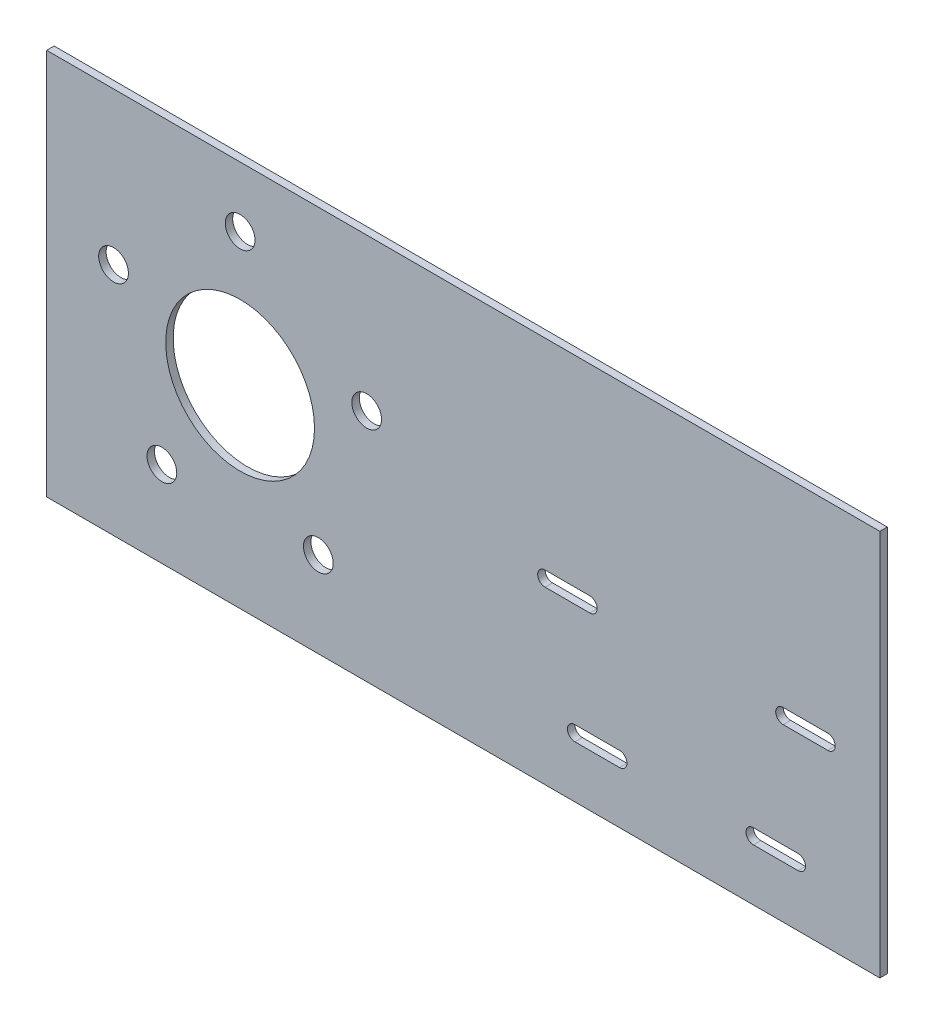
ISO-10303-21;
HEADER;
FILE_DESCRIPTION(('STEP AP214'),'2;1');
FILE_NAME('part.step','',(''),(''),'','','');
FILE_SCHEMA(('AUTOMOTIVE_DESIGN { 1 0 10303 214 1 1 1 1 }'));
ENDSEC;
DATA;
#1=APPLICATION_CONTEXT('core data for automotive mechanical design processes');
#2=APPLICATION_PROTOCOL_DEFINITION('international standard','automotive_design',2000,#1);
#3=PRODUCT_CONTEXT('',#1,'mechanical');
#4=PRODUCT('Part','Part','',(#3));
#5=PRODUCT_RELATED_PRODUCT_CATEGORY('part','',(#4));
#6=PRODUCT_DEFINITION_FORMATION('','',#4);
#7=PRODUCT_DEFINITION_CONTEXT('part definition',#1,'design');
#8=PRODUCT_DEFINITION('design','',#6,#7);
#9=PRODUCT_DEFINITION_SHAPE('','',#8);
#10=(LENGTH_UNIT() NAMED_UNIT(*) SI_UNIT(.MILLI.,.METRE.));
#11=(NAMED_UNIT(*) PLANE_ANGLE_UNIT() SI_UNIT($,.RADIAN.));
#12=(NAMED_UNIT(*) SI_UNIT($,.STERADIAN.) SOLID_ANGLE_UNIT());
#13=UNCERTAINTY_MEASURE_WITH_UNIT(LENGTH_MEASURE(1.E-05),#10,'distance_accuracy_value','');
#14=(GEOMETRIC_REPRESENTATION_CONTEXT(3) GLOBAL_UNCERTAINTY_ASSIGNED_CONTEXT((#13)) GLOBAL_UNIT_ASSIGNED_CONTEXT((#10,
#11,#12)) REPRESENTATION_CONTEXT('',''));
#15=CARTESIAN_POINT('',(0.,0.,0.));
#16=DIRECTION('',(0.,0.,1.));
#17=DIRECTION('',(1.,0.,0.));
#18=AXIS2_PLACEMENT_3D('',#15,#16,#17);
#19=CARTESIAN_POINT('',(-82.55,82.5499999999999,3.175));
#20=DIRECTION('',(0.,0.,1.));
#21=DIRECTION('',(1.,0.,0.));
#22=AXIS2_PLACEMENT_3D('',#19,#20,#21);
#23=PLANE('',#22);
#24=CARTESIAN_POINT('',(142.875,-57.15,3.175));
#25=DIRECTION('',(0.,0.,1.));
#26=DIRECTION('',(1.,0.,0.));
#27=AXIS2_PLACEMENT_3D('',#24,#25,#26);
#28=CIRCLE('',#27,3.17500000000001);
#29=CARTESIAN_POINT('',(142.875,-53.975,3.175));
#30=VERTEX_POINT('',#29);
#31=CARTESIAN_POINT('',(142.875,-60.325,3.175));
#32=VERTEX_POINT('',#31);
#33=EDGE_CURVE('E49',#30,#32,#28,.T.);
#34=ORIENTED_EDGE('',*,*,#33,.F.);
#35=DIRECTION('',(-1.,0.,0.));
#36=VECTOR('',#35,1.);
#37=CARTESIAN_POINT('',(142.875,-53.975,3.175));
#38=LINE('',#37,#36);
#39=CARTESIAN_POINT('',(161.925,-53.9749999999999,3.175));
#40=VERTEX_POINT('',#39);
#41=EDGE_CURVE('E189',#40,#30,#38,.T.);
#42=ORIENTED_EDGE('',*,*,#41,.F.);
#43=CARTESIAN_POINT('',(161.925,-57.15,3.175));
#44=DIRECTION('',(0.,0.,1.));
#45=DIRECTION('',(1.,0.,0.));
#46=AXIS2_PLACEMENT_3D('',#43,#44,#45);
#47=CIRCLE('',#46,3.17500000000001);
#48=CARTESIAN_POINT('',(161.925,-60.325,3.175));
#49=VERTEX_POINT('',#48);
#50=EDGE_CURVE('E192',#49,#40,#47,.T.);
#51=ORIENTED_EDGE('',*,*,#50,.F.);
#52=DIRECTION('',(1.,0.,0.));
#53=VECTOR('',#52,1.);
#54=CARTESIAN_POINT('',(142.875,-60.325,3.175));
#55=LINE('',#54,#53);
#56=EDGE_CURVE('E198',#32,#49,#55,.T.);
#57=ORIENTED_EDGE('',*,*,#56,.F.);
#58=EDGE_LOOP('',(#34,#42,#51,#57));
#59=FACE_BOUND('',#58,.T.);
#60=CARTESIAN_POINT('',(238.125,-57.15,3.175));
#61=DIRECTION('',(0.,0.,1.));
#62=DIRECTION('',(1.,0.,0.));
#63=AXIS2_PLACEMENT_3D('',#60,#61,#62);
#64=CIRCLE('',#63,3.17499999999999);
#65=CARTESIAN_POINT('',(238.125,-60.3249999999999,3.175));
#66=VERTEX_POINT('',#65);
#67=CARTESIAN_POINT('',(238.125,-53.975,3.175));
#68=VERTEX_POINT('',#67);
#69=EDGE_CURVE('E204',#66,#68,#64,.T.);
#70=ORIENTED_EDGE('',*,*,#69,.F.);
#71=DIRECTION('',(1.,0.,0.));
#72=VECTOR('',#71,1.);
#73=CARTESIAN_POINT('',(238.125,-60.3249999999999,3.175));
#74=LINE('',#73,#72);
#75=CARTESIAN_POINT('',(219.075,-60.325,3.175));
#76=VERTEX_POINT('',#75);
#77=EDGE_CURVE('E212',#76,#66,#74,.T.);
#78=ORIENTED_EDGE('',*,*,#77,.F.);
#79=CARTESIAN_POINT('',(219.075,-57.15,3.175));
#80=DIRECTION('',(0.,0.,1.));
#81=DIRECTION('',(1.,0.,0.));
#82=AXIS2_PLACEMENT_3D('',#79,#80,#81);
#83=CIRCLE('',#82,3.17499999999999);
#84=CARTESIAN_POINT('',(219.075,-53.975,3.175));
#85=VERTEX_POINT('',#84);
#86=EDGE_CURVE('E226',#85,#76,#83,.T.);
#87=ORIENTED_EDGE('',*,*,#86,.F.);
#88=DIRECTION('',(-1.,0.,0.));
#89=VECTOR('',#88,1.);
#90=CARTESIAN_POINT('',(238.125,-53.975,3.175));
#91=LINE('',#90,#89);
#92=EDGE_CURVE('E223',#68,#85,#91,.T.);
#93=ORIENTED_EDGE('',*,*,#92,.F.);
#94=EDGE_LOOP('',(#70,#78,#87,#93));
#95=FACE_BOUND('',#94,.T.);
#96=CARTESIAN_POINT('',(250.825,-6.34999999999996,3.175));
#97=DIRECTION('',(0.,0.,1.));
#98=DIRECTION('',(1.,0.,0.));
#99=AXIS2_PLACEMENT_3D('',#96,#97,#98);
#100=CIRCLE('',#99,3.175);
#101=CARTESIAN_POINT('',(250.825,-9.52499999999996,3.175));
#102=VERTEX_POINT('',#101);
#103=CARTESIAN_POINT('',(250.825,-3.17499999999997,3.175));
#104=VERTEX_POINT('',#103);
#105=EDGE_CURVE('E233',#102,#104,#100,.T.);
#106=ORIENTED_EDGE('',*,*,#105,.F.);
#107=DIRECTION('',(1.,0.,0.));
#108=VECTOR('',#107,1.);
#109=CARTESIAN_POINT('',(250.825,-9.52499999999996,3.175));
#110=LINE('',#109,#108);
#111=CARTESIAN_POINT('',(231.775,-9.52499999999997,3.175));
#112=VERTEX_POINT('',#111);
#113=EDGE_CURVE('E244',#112,#102,#110,.T.);
#114=ORIENTED_EDGE('',*,*,#113,.F.);
#115=CARTESIAN_POINT('',(231.775,-6.34999999999997,3.175));
#116=DIRECTION('',(0.,0.,1.));
#117=DIRECTION('',(1.,0.,0.));
#118=AXIS2_PLACEMENT_3D('',#115,#116,#117);
#119=CIRCLE('',#118,3.175);
#120=CARTESIAN_POINT('',(231.775,-3.17499999999997,3.175));
#121=VERTEX_POINT('',#120);
#122=EDGE_CURVE('E258',#121,#112,#119,.T.);
#123=ORIENTED_EDGE('',*,*,#122,.F.);
#124=DIRECTION('',(-1.,0.,0.));
#125=VECTOR('',#124,1.);
#126=CARTESIAN_POINT('',(250.825,-3.17499999999996,3.175));
#127=LINE('',#126,#125);
#128=EDGE_CURVE('E255',#104,#121,#127,.T.);
#129=ORIENTED_EDGE('',*,*,#128,.F.);
#130=EDGE_LOOP('',(#106,#114,#123,#129));
#131=FACE_BOUND('',#130,.T.);
#132=CARTESIAN_POINT('',(149.225,-6.34999999999996,3.175));
#133=DIRECTION('',(0.,0.,1.));
#134=DIRECTION('',(1.,0.,0.));
#135=AXIS2_PLACEMENT_3D('',#132,#133,#134);
#136=CIRCLE('',#135,3.175);
#137=CARTESIAN_POINT('',(149.225,-9.52499999999997,3.175));
#138=VERTEX_POINT('',#137);
#139=CARTESIAN_POINT('',(149.225,-3.17499999999995,3.175));
#140=VERTEX_POINT('',#139);
#141=EDGE_CURVE('E265',#138,#140,#136,.T.);
#142=ORIENTED_EDGE('',*,*,#141,.F.);
#143=DIRECTION('',(1.,0.,0.));
#144=VECTOR('',#143,1.);
#145=CARTESIAN_POINT('',(149.225,-9.52499999999997,3.175));
#146=LINE('',#145,#144);
#147=CARTESIAN_POINT('',(130.175,-9.52499999999997,3.175));
#148=VERTEX_POINT('',#147);
#149=EDGE_CURVE('E276',#148,#138,#146,.T.);
#150=ORIENTED_EDGE('',*,*,#149,.F.);
#151=CARTESIAN_POINT('',(130.175,-6.34999999999997,3.175));
#152=DIRECTION('',(0.,0.,1.));
#153=DIRECTION('',(1.,0.,0.));
#154=AXIS2_PLACEMENT_3D('',#151,#152,#153);
#155=CIRCLE('',#154,3.175);
#156=CARTESIAN_POINT('',(130.175,-3.17499999999997,3.175));
#157=VERTEX_POINT('',#156);
#158=EDGE_CURVE('E290',#157,#148,#155,.T.);
#159=ORIENTED_EDGE('',*,*,#158,.F.);
#160=DIRECTION('',(-1.,0.,0.));
#161=VECTOR('',#160,1.);
#162=CARTESIAN_POINT('',(149.225,-3.17499999999996,3.175));
#163=LINE('',#162,#161);
#164=EDGE_CURVE('E287',#140,#157,#163,.T.);
#165=ORIENTED_EDGE('',*,*,#164,.F.);
#166=EDGE_LOOP('',(#142,#150,#159,#165));
#167=FACE_BOUND('',#166,.T.);
#168=CARTESIAN_POINT('',(33.3855613710941,-45.9512830759539,3.175));
#169=DIRECTION('',(0.,0.,1.));
#170=DIRECTION('',(1.,0.,0.));
#171=AXIS2_PLACEMENT_3D('',#168,#169,#170);
#172=CIRCLE('',#171,6.35);
#173=CARTESIAN_POINT('',(39.7355613710941,-45.9512830759539,3.175));
#174=VERTEX_POINT('',#173);
#175=EDGE_CURVE('E310',#174,#174,#172,.T.);
#176=ORIENTED_EDGE('',*,*,#175,.F.);
#177=EDGE_LOOP('',(#176));
#178=FACE_BOUND('',#177,.T.);
#179=CARTESIAN_POINT('',(0.,56.798909535215,3.175));
#180=DIRECTION('',(0.,0.,1.));
#181=DIRECTION('',(1.,0.,0.));
#182=AXIS2_PLACEMENT_3D('',#179,#180,#181);
#183=CIRCLE('',#182,6.35);
#184=CARTESIAN_POINT('',(6.35,56.798909535215,3.175));
#185=VERTEX_POINT('',#184);
#186=EDGE_CURVE('E322',#185,#185,#183,.T.);
#187=ORIENTED_EDGE('',*,*,#186,.F.);
#188=EDGE_LOOP('',(#187));
#189=FACE_BOUND('',#188,.T.);
#190=CARTESIAN_POINT('',(0.,0.,3.175));
#191=DIRECTION('',(0.,0.,1.));
#192=DIRECTION('',(1.,0.,0.));
#193=AXIS2_PLACEMENT_3D('',#190,#191,#192);
#194=CIRCLE('',#193,31.75);
#195=CARTESIAN_POINT('',(31.75,0.,3.175));
#196=VERTEX_POINT('',#195);
#197=EDGE_CURVE('E334',#196,#196,#194,.T.);
#198=ORIENTED_EDGE('',*,*,#197,.F.);
#199=EDGE_LOOP('',(#198));
#200=FACE_BOUND('',#199,.T.);
#201=DIRECTION('',(0.,-1.,0.));
#202=VECTOR('',#201,1.);
#203=CARTESIAN_POINT('',(-82.55,-82.5500000000001,3.175));
#204=LINE('',#203,#202);
#205=CARTESIAN_POINT('',(-82.55,82.5499999999999,3.175));
#206=VERTEX_POINT('',#205);
#207=CARTESIAN_POINT('',(-82.55,-82.5500000000001,3.175));
#208=VERTEX_POINT('',#207);
#209=EDGE_CURVE('E340',#206,#208,#204,.T.);
#210=ORIENTED_EDGE('',*,*,#209,.T.);
#211=DIRECTION('',(1.,0.,0.));
#212=VECTOR('',#211,1.);
#213=CARTESIAN_POINT('',(273.05,-82.55,3.175));
#214=LINE('',#213,#212);
#215=CARTESIAN_POINT('',(273.05,-82.55,3.175));
#216=VERTEX_POINT('',#215);
#217=EDGE_CURVE('E343',#208,#216,#214,.T.);
#218=ORIENTED_EDGE('',*,*,#217,.T.);
#219=DIRECTION('',(0.,1.,0.));
#220=VECTOR('',#219,1.);
#221=CARTESIAN_POINT('',(273.05,-82.55,3.175));
#222=LINE('',#221,#220);
#223=CARTESIAN_POINT('',(273.05,82.55,3.175));
#224=VERTEX_POINT('',#223);
#225=EDGE_CURVE('E346',#216,#224,#222,.T.);
#226=ORIENTED_EDGE('',*,*,#225,.T.);
#227=DIRECTION('',(-1.,0.,0.));
#228=VECTOR('',#227,1.);
#229=CARTESIAN_POINT('',(273.05,82.55,3.175));
#230=LINE('',#229,#228);
#231=EDGE_CURVE('E348',#224,#206,#230,.T.);
#232=ORIENTED_EDGE('',*,*,#231,.T.);
#233=EDGE_LOOP('',(#210,#218,#226,#232));
#234=FACE_BOUND('',#233,.T.);
#235=CARTESIAN_POINT('',(-54.0189730319252,17.5518283083465,3.175));
#236=DIRECTION('',(0.,0.,1.));
#237=DIRECTION('',(1.,0.,0.));
#238=AXIS2_PLACEMENT_3D('',#235,#236,#237);
#239=CIRCLE('',#238,6.35);
#240=CARTESIAN_POINT('',(-47.6689730319252,17.5518283083465,3.175));
#241=VERTEX_POINT('',#240);
#242=EDGE_CURVE('E328',#241,#241,#239,.T.);
#243=ORIENTED_EDGE('',*,*,#242,.F.);
#244=EDGE_LOOP('',(#243));
#245=FACE_BOUND('',#244,.T.);
#246=CARTESIAN_POINT('',(54.0189730319249,17.5518283083473,3.175));
#247=DIRECTION('',(0.,0.,1.));
#248=DIRECTION('',(1.,0.,0.));
#249=AXIS2_PLACEMENT_3D('',#246,#247,#248);
#250=CIRCLE('',#249,6.35);
#251=CARTESIAN_POINT('',(60.3689730319249,17.5518283083473,3.175));
#252=VERTEX_POINT('',#251);
#253=EDGE_CURVE('E316',#252,#252,#250,.T.);
#254=ORIENTED_EDGE('',*,*,#253,.F.);
#255=EDGE_LOOP('',(#254));
#256=FACE_BOUND('',#255,.T.);
#257=CARTESIAN_POINT('',(-33.3855613710934,-45.9512830759543,3.175));
#258=DIRECTION('',(0.,0.,1.));
#259=DIRECTION('',(1.,0.,0.));
#260=AXIS2_PLACEMENT_3D('',#257,#258,#259);
#261=CIRCLE('',#260,6.35);
#262=CARTESIAN_POINT('',(-27.0355613710934,-45.9512830759543,3.175));
#263=VERTEX_POINT('',#262);
#264=EDGE_CURVE('E304',#263,#263,#261,.T.);
#265=ORIENTED_EDGE('',*,*,#264,.F.);
#266=EDGE_LOOP('',(#265));
#267=FACE_BOUND('',#266,.T.);
#268=ADVANCED_FACE('F34',(#59,#95,#131,#167,#178,#189,#200,#234,#245,#256,#267),#23,.T.);
#269=CARTESIAN_POINT('',(-82.55,82.5499999999999,0.));
#270=DIRECTION('',(0.,0.,1.));
#271=DIRECTION('',(1.,0.,0.));
#272=AXIS2_PLACEMENT_3D('',#269,#270,#271);
#273=PLANE('',#272);
#274=DIRECTION('',(-1.,0.,0.));
#275=VECTOR('',#274,1.);
#276=CARTESIAN_POINT('',(142.875,-53.975,0.));
#277=LINE('',#276,#275);
#278=CARTESIAN_POINT('',(161.925,-53.9749999999999,0.));
#279=VERTEX_POINT('',#278);
#280=CARTESIAN_POINT('',(142.875,-53.975,0.));
#281=VERTEX_POINT('',#280);
#282=EDGE_CURVE('E179',#279,#281,#277,.T.);
#283=ORIENTED_EDGE('',*,*,#282,.T.);
#284=CARTESIAN_POINT('',(142.875,-57.15,0.));
#285=DIRECTION('',(0.,0.,1.));
#286=DIRECTION('',(1.,0.,0.));
#287=AXIS2_PLACEMENT_3D('',#284,#285,#286);
#288=CIRCLE('',#287,3.17500000000001);
#289=CARTESIAN_POINT('',(142.875,-60.325,0.));
#290=VERTEX_POINT('',#289);
#291=EDGE_CURVE('E173',#281,#290,#288,.T.);
#292=ORIENTED_EDGE('',*,*,#291,.T.);
#293=DIRECTION('',(1.,0.,0.));
#294=VECTOR('',#293,1.);
#295=CARTESIAN_POINT('',(142.875,-60.325,0.));
#296=LINE('',#295,#294);
#297=CARTESIAN_POINT('',(161.925,-60.325,0.));
#298=VERTEX_POINT('',#297);
#299=EDGE_CURVE('E182',#290,#298,#296,.T.);
#300=ORIENTED_EDGE('',*,*,#299,.T.);
#301=CARTESIAN_POINT('',(161.925,-57.15,0.));
#302=DIRECTION('',(0.,0.,1.));
#303=DIRECTION('',(1.,0.,0.));
#304=AXIS2_PLACEMENT_3D('',#301,#302,#303);
#305=CIRCLE('',#304,3.17500000000001);
#306=EDGE_CURVE('E57',#298,#279,#305,.T.);
#307=ORIENTED_EDGE('',*,*,#306,.T.);
#308=EDGE_LOOP('',(#283,#292,#300,#307));
#309=FACE_BOUND('',#308,.T.);
#310=DIRECTION('',(1.,0.,0.));
#311=VECTOR('',#310,1.);
#312=CARTESIAN_POINT('',(238.125,-60.3249999999999,0.));
#313=LINE('',#312,#311);
#314=CARTESIAN_POINT('',(219.075,-60.325,0.));
#315=VERTEX_POINT('',#314);
#316=CARTESIAN_POINT('',(238.125,-60.3249999999999,0.));
#317=VERTEX_POINT('',#316);
#318=EDGE_CURVE('E218',#315,#317,#313,.T.);
#319=ORIENTED_EDGE('',*,*,#318,.T.);
#320=CARTESIAN_POINT('',(238.125,-57.15,0.));
#321=DIRECTION('',(0.,0.,1.));
#322=DIRECTION('',(1.,0.,0.));
#323=AXIS2_PLACEMENT_3D('',#320,#321,#322);
#324=CIRCLE('',#323,3.17499999999999);
#325=CARTESIAN_POINT('',(238.125,-53.975,0.));
#326=VERTEX_POINT('',#325);
#327=EDGE_CURVE('E208',#317,#326,#324,.T.);
#328=ORIENTED_EDGE('',*,*,#327,.T.);
#329=DIRECTION('',(-1.,0.,0.));
#330=VECTOR('',#329,1.);
#331=CARTESIAN_POINT('',(238.125,-53.975,0.));
#332=LINE('',#331,#330);
#333=CARTESIAN_POINT('',(219.075,-53.975,0.));
#334=VERTEX_POINT('',#333);
#335=EDGE_CURVE('E211',#326,#334,#332,.T.);
#336=ORIENTED_EDGE('',*,*,#335,.T.);
#337=CARTESIAN_POINT('',(219.075,-57.15,0.));
#338=DIRECTION('',(0.,0.,1.));
#339=DIRECTION('',(1.,0.,0.));
#340=AXIS2_PLACEMENT_3D('',#337,#338,#339);
#341=CIRCLE('',#340,3.17499999999999);
#342=EDGE_CURVE('E215',#334,#315,#341,.T.);
#343=ORIENTED_EDGE('',*,*,#342,.T.);
#344=EDGE_LOOP('',(#319,#328,#336,#343));
#345=FACE_BOUND('',#344,.T.);
#346=DIRECTION('',(1.,0.,0.));
#347=VECTOR('',#346,1.);
#348=CARTESIAN_POINT('',(250.825,-9.52499999999996,0.));
#349=LINE('',#348,#347);
#350=CARTESIAN_POINT('',(231.775,-9.52499999999997,0.));
#351=VERTEX_POINT('',#350);
#352=CARTESIAN_POINT('',(250.825,-9.52499999999996,0.));
#353=VERTEX_POINT('',#352);
#354=EDGE_CURVE('E250',#351,#353,#349,.T.);
#355=ORIENTED_EDGE('',*,*,#354,.T.);
#356=CARTESIAN_POINT('',(250.825,-6.34999999999996,0.));
#357=DIRECTION('',(0.,0.,1.));
#358=DIRECTION('',(1.,0.,0.));
#359=AXIS2_PLACEMENT_3D('',#356,#357,#358);
#360=CIRCLE('',#359,3.175);
#361=CARTESIAN_POINT('',(250.825,-3.17499999999996,0.));
#362=VERTEX_POINT('',#361);
#363=EDGE_CURVE('E240',#353,#362,#360,.T.);
#364=ORIENTED_EDGE('',*,*,#363,.T.);
#365=DIRECTION('',(-1.,0.,0.));
#366=VECTOR('',#365,1.);
#367=CARTESIAN_POINT('',(250.825,-3.17499999999996,0.));
#368=LINE('',#367,#366);
#369=CARTESIAN_POINT('',(231.775,-3.17499999999998,0.));
#370=VERTEX_POINT('',#369);
#371=EDGE_CURVE('E243',#362,#370,#368,.T.);
#372=ORIENTED_EDGE('',*,*,#371,.T.);
#373=CARTESIAN_POINT('',(231.775,-6.34999999999997,0.));
#374=DIRECTION('',(0.,0.,1.));
#375=DIRECTION('',(1.,0.,0.));
#376=AXIS2_PLACEMENT_3D('',#373,#374,#375);
#377=CIRCLE('',#376,3.175);
#378=EDGE_CURVE('E247',#370,#351,#377,.T.);
#379=ORIENTED_EDGE('',*,*,#378,.T.);
#380=EDGE_LOOP('',(#355,#364,#372,#379));
#381=FACE_BOUND('',#380,.T.);
#382=DIRECTION('',(1.,0.,0.));
#383=VECTOR('',#382,1.);
#384=CARTESIAN_POINT('',(149.225,-9.52499999999997,0.));
#385=LINE('',#384,#383);
#386=CARTESIAN_POINT('',(130.175,-9.52499999999997,0.));
#387=VERTEX_POINT('',#386);
#388=CARTESIAN_POINT('',(149.225,-9.52499999999997,0.));
#389=VERTEX_POINT('',#388);
#390=EDGE_CURVE('E282',#387,#389,#385,.T.);
#391=ORIENTED_EDGE('',*,*,#390,.T.);
#392=CARTESIAN_POINT('',(149.225,-6.34999999999996,0.));
#393=DIRECTION('',(0.,0.,1.));
#394=DIRECTION('',(1.,0.,0.));
#395=AXIS2_PLACEMENT_3D('',#392,#393,#394);
#396=CIRCLE('',#395,3.175);
#397=CARTESIAN_POINT('',(149.225,-3.17499999999996,0.));
#398=VERTEX_POINT('',#397);
#399=EDGE_CURVE('E272',#389,#398,#396,.T.);
#400=ORIENTED_EDGE('',*,*,#399,.T.);
#401=DIRECTION('',(-1.,0.,0.));
#402=VECTOR('',#401,1.);
#403=CARTESIAN_POINT('',(149.225,-3.17499999999996,0.));
#404=LINE('',#403,#402);
#405=CARTESIAN_POINT('',(130.175,-3.17499999999996,0.));
#406=VERTEX_POINT('',#405);
#407=EDGE_CURVE('E275',#398,#406,#404,.T.);
#408=ORIENTED_EDGE('',*,*,#407,.T.);
#409=CARTESIAN_POINT('',(130.175,-6.34999999999997,0.));
#410=DIRECTION('',(0.,0.,1.));
#411=DIRECTION('',(1.,0.,0.));
#412=AXIS2_PLACEMENT_3D('',#409,#410,#411);
#413=CIRCLE('',#412,3.175);
#414=EDGE_CURVE('E279',#406,#387,#413,.T.);
#415=ORIENTED_EDGE('',*,*,#414,.T.);
#416=EDGE_LOOP('',(#391,#400,#408,#415));
#417=FACE_BOUND('',#416,.T.);
#418=CARTESIAN_POINT('',(33.3855613710941,-45.9512830759539,0.));
#419=DIRECTION('',(0.,0.,1.));
#420=DIRECTION('',(1.,0.,0.));
#421=AXIS2_PLACEMENT_3D('',#418,#419,#420);
#422=CIRCLE('',#421,6.35);
#423=CARTESIAN_POINT('',(39.7355613710941,-45.9512830759539,0.));
#424=VERTEX_POINT('',#423);
#425=EDGE_CURVE('E307',#424,#424,#422,.T.);
#426=ORIENTED_EDGE('',*,*,#425,.T.);
#427=EDGE_LOOP('',(#426));
#428=FACE_BOUND('',#427,.T.);
#429=CARTESIAN_POINT('',(0.,56.798909535215,0.));
#430=DIRECTION('',(0.,0.,1.));
#431=DIRECTION('',(1.,0.,0.));
#432=AXIS2_PLACEMENT_3D('',#429,#430,#431);
#433=CIRCLE('',#432,6.35);
#434=CARTESIAN_POINT('',(6.35,56.798909535215,0.));
#435=VERTEX_POINT('',#434);
#436=EDGE_CURVE('E319',#435,#435,#433,.T.);
#437=ORIENTED_EDGE('',*,*,#436,.T.);
#438=EDGE_LOOP('',(#437));
#439=FACE_BOUND('',#438,.T.);
#440=CARTESIAN_POINT('',(0.,0.,0.));
#441=DIRECTION('',(0.,0.,1.));
#442=DIRECTION('',(1.,0.,0.));
#443=AXIS2_PLACEMENT_3D('',#440,#441,#442);
#444=CIRCLE('',#443,31.75);
#445=CARTESIAN_POINT('',(31.75,0.,0.));
#446=VERTEX_POINT('',#445);
#447=EDGE_CURVE('E331',#446,#446,#444,.T.);
#448=ORIENTED_EDGE('',*,*,#447,.T.);
#449=EDGE_LOOP('',(#448));
#450=FACE_BOUND('',#449,.T.);
#451=DIRECTION('',(0.,-1.,0.));
#452=VECTOR('',#451,1.);
#453=CARTESIAN_POINT('',(-82.55,-82.5500000000001,0.));
#454=LINE('',#453,#452);
#455=CARTESIAN_POINT('',(-82.55,82.5499999999999,0.));
#456=VERTEX_POINT('',#455);
#457=CARTESIAN_POINT('',(-82.55,-82.5500000000001,0.));
#458=VERTEX_POINT('',#457);
#459=EDGE_CURVE('E337',#456,#458,#454,.T.);
#460=ORIENTED_EDGE('',*,*,#459,.F.);
#461=DIRECTION('',(-1.,0.,0.));
#462=VECTOR('',#461,1.);
#463=CARTESIAN_POINT('',(273.05,82.55,0.));
#464=LINE('',#463,#462);
#465=CARTESIAN_POINT('',(273.05,82.55,0.));
#466=VERTEX_POINT('',#465);
#467=EDGE_CURVE('E344',#466,#456,#464,.T.);
#468=ORIENTED_EDGE('',*,*,#467,.F.);
#469=DIRECTION('',(0.,1.,0.));
#470=VECTOR('',#469,1.);
#471=CARTESIAN_POINT('',(273.05,-82.55,0.));
#472=LINE('',#471,#470);
#473=CARTESIAN_POINT('',(273.05,-82.55,0.));
#474=VERTEX_POINT('',#473);
#475=EDGE_CURVE('E355',#474,#466,#472,.T.);
#476=ORIENTED_EDGE('',*,*,#475,.F.);
#477=DIRECTION('',(1.,0.,0.));
#478=VECTOR('',#477,1.);
#479=CARTESIAN_POINT('',(273.05,-82.55,0.));
#480=LINE('',#479,#478);
#481=EDGE_CURVE('E353',#458,#474,#480,.T.);
#482=ORIENTED_EDGE('',*,*,#481,.F.);
#483=EDGE_LOOP('',(#460,#468,#476,#482));
#484=FACE_BOUND('',#483,.T.);
#485=CARTESIAN_POINT('',(-54.0189730319252,17.5518283083465,0.));
#486=DIRECTION('',(0.,0.,1.));
#487=DIRECTION('',(1.,0.,0.));
#488=AXIS2_PLACEMENT_3D('',#485,#486,#487);
#489=CIRCLE('',#488,6.35);
#490=CARTESIAN_POINT('',(-47.6689730319252,17.5518283083465,0.));
#491=VERTEX_POINT('',#490);
#492=EDGE_CURVE('E325',#491,#491,#489,.T.);
#493=ORIENTED_EDGE('',*,*,#492,.T.);
#494=EDGE_LOOP('',(#493));
#495=FACE_BOUND('',#494,.T.);
#496=CARTESIAN_POINT('',(54.0189730319249,17.5518283083473,0.));
#497=DIRECTION('',(0.,0.,1.));
#498=DIRECTION('',(1.,0.,0.));
#499=AXIS2_PLACEMENT_3D('',#496,#497,#498);
#500=CIRCLE('',#499,6.35);
#501=CARTESIAN_POINT('',(60.3689730319249,17.5518283083473,0.));
#502=VERTEX_POINT('',#501);
#503=EDGE_CURVE('E313',#502,#502,#500,.T.);
#504=ORIENTED_EDGE('',*,*,#503,.T.);
#505=EDGE_LOOP('',(#504));
#506=FACE_BOUND('',#505,.T.);
#507=CARTESIAN_POINT('',(-33.3855613710934,-45.9512830759543,0.));
#508=DIRECTION('',(0.,0.,1.));
#509=DIRECTION('',(1.,0.,0.));
#510=AXIS2_PLACEMENT_3D('',#507,#508,#509);
#511=CIRCLE('',#510,6.35);
#512=CARTESIAN_POINT('',(-27.0355613710934,-45.9512830759543,0.));
#513=VERTEX_POINT('',#512);
#514=EDGE_CURVE('E297',#513,#513,#511,.T.);
#515=ORIENTED_EDGE('',*,*,#514,.T.);
#516=EDGE_LOOP('',(#515));
#517=FACE_BOUND('',#516,.T.);
#518=ADVANCED_FACE('F186',(#309,#345,#381,#417,#428,#439,#450,#484,#495,#506,#517),#273,.F.);
#519=CARTESIAN_POINT('',(-82.55,-82.5500000000001,3.175));
#520=DIRECTION('',(1.,0.,0.));
#521=DIRECTION('',(0.,1.,0.));
#522=AXIS2_PLACEMENT_3D('',#519,#520,#521);
#523=PLANE('',#522);
#524=ORIENTED_EDGE('',*,*,#459,.T.);
#525=DIRECTION('',(0.,0.,-1.));
#526=VECTOR('',#525,1.);
#527=CARTESIAN_POINT('',(-82.55,-82.5500000000001,3.175));
#528=LINE('',#527,#526);
#529=EDGE_CURVE('E11',#208,#458,#528,.T.);
#530=ORIENTED_EDGE('',*,*,#529,.F.);
#531=ORIENTED_EDGE('',*,*,#209,.F.);
#532=DIRECTION('',(0.,0.,-1.));
#533=VECTOR('',#532,1.);
#534=CARTESIAN_POINT('',(-82.55,82.5499999999999,3.175));
#535=LINE('',#534,#533);
#536=EDGE_CURVE('E350',#206,#456,#535,.T.);
#537=ORIENTED_EDGE('',*,*,#536,.T.);
#538=EDGE_LOOP('',(#524,#530,#531,#537));
#539=FACE_BOUND('',#538,.T.);
#540=ADVANCED_FACE('F36',(#539),#523,.F.);
#541=CARTESIAN_POINT('',(273.05,-82.55,3.175));
#542=DIRECTION('',(0.,1.,0.));
#543=DIRECTION('',(-1.,0.,0.));
#544=AXIS2_PLACEMENT_3D('',#541,#542,#543);
#545=PLANE('',#544);
#546=ORIENTED_EDGE('',*,*,#481,.T.);
#547=DIRECTION('',(0.,0.,-1.));
#548=VECTOR('',#547,1.);
#549=CARTESIAN_POINT('',(273.05,-82.55,3.175));
#550=LINE('',#549,#548);
#551=EDGE_CURVE('E42',#216,#474,#550,.T.);
#552=ORIENTED_EDGE('',*,*,#551,.F.);
#553=ORIENTED_EDGE('',*,*,#217,.F.);
#554=ORIENTED_EDGE('',*,*,#529,.T.);
#555=EDGE_LOOP('',(#546,#552,#553,#554));
#556=FACE_BOUND('',#555,.T.);
#557=ADVANCED_FACE('F383',(#556),#545,.F.);
#558=CARTESIAN_POINT('',(273.05,-82.55,3.175));
#559=DIRECTION('',(-1.,0.,0.));
#560=DIRECTION('',(0.,0.,1.));
#561=AXIS2_PLACEMENT_3D('',#558,#559,#560);
#562=PLANE('',#561);
#563=ORIENTED_EDGE('',*,*,#475,.T.);
#564=DIRECTION('',(0.,0.,-1.));
#565=VECTOR('',#564,1.);
#566=CARTESIAN_POINT('',(273.05,82.55,3.175));
#567=LINE('',#566,#565);
#568=EDGE_CURVE('E360',#224,#466,#567,.T.);
#569=ORIENTED_EDGE('',*,*,#568,.F.);
#570=ORIENTED_EDGE('',*,*,#225,.F.);
#571=ORIENTED_EDGE('',*,*,#551,.T.);
#572=EDGE_LOOP('',(#563,#569,#570,#571));
#573=FACE_BOUND('',#572,.T.);
#574=ADVANCED_FACE('F367',(#573),#562,.F.);
#575=CARTESIAN_POINT('',(273.05,82.55,3.175));
#576=DIRECTION('',(0.,-1.,0.));
#577=DIRECTION('',(1.,0.,0.));
#578=AXIS2_PLACEMENT_3D('',#575,#576,#577);
#579=PLANE('',#578);
#580=ORIENTED_EDGE('',*,*,#467,.T.);
#581=ORIENTED_EDGE('',*,*,#536,.F.);
#582=ORIENTED_EDGE('',*,*,#231,.F.);
#583=ORIENTED_EDGE('',*,*,#568,.T.);
#584=EDGE_LOOP('',(#580,#581,#582,#583));
#585=FACE_BOUND('',#584,.T.);
#586=ADVANCED_FACE('F376',(#585),#579,.F.);
#587=CARTESIAN_POINT('',(0.,0.,3.175));
#588=DIRECTION('',(0.,0.,-1.));
#589=DIRECTION('',(-1.,0.,0.));
#590=AXIS2_PLACEMENT_3D('',#587,#588,#589);
#591=CYLINDRICAL_SURFACE('',#590,31.75);
#592=ORIENTED_EDGE('',*,*,#197,.T.);
#593=EDGE_LOOP('',(#592));
#594=FACE_BOUND('',#593,.T.);
#595=ORIENTED_EDGE('',*,*,#447,.F.);
#596=EDGE_LOOP('',(#595));
#597=FACE_BOUND('',#596,.T.);
#598=ADVANCED_FACE('F399',(#594,#597),#591,.F.);
#599=CARTESIAN_POINT('',(-54.0189730319252,17.5518283083465,3.175));
#600=DIRECTION('',(0.,0.,-1.));
#601=DIRECTION('',(-1.,0.,0.));
#602=AXIS2_PLACEMENT_3D('',#599,#600,#601);
#603=CYLINDRICAL_SURFACE('',#602,6.35);
#604=ORIENTED_EDGE('',*,*,#242,.T.);
#605=EDGE_LOOP('',(#604));
#606=FACE_BOUND('',#605,.T.);
#607=ORIENTED_EDGE('',*,*,#492,.F.);
#608=EDGE_LOOP('',(#607));
#609=FACE_BOUND('',#608,.T.);
#610=ADVANCED_FACE('F406',(#606,#609),#603,.F.);
#611=CARTESIAN_POINT('',(0.,56.798909535215,3.175));
#612=DIRECTION('',(0.,0.,-1.));
#613=DIRECTION('',(-1.,0.,0.));
#614=AXIS2_PLACEMENT_3D('',#611,#612,#613);
#615=CYLINDRICAL_SURFACE('',#614,6.35);
#616=ORIENTED_EDGE('',*,*,#186,.T.);
#617=EDGE_LOOP('',(#616));
#618=FACE_BOUND('',#617,.T.);
#619=ORIENTED_EDGE('',*,*,#436,.F.);
#620=EDGE_LOOP('',(#619));
#621=FACE_BOUND('',#620,.T.);
#622=ADVANCED_FACE('F411',(#618,#621),#615,.F.);
#623=CARTESIAN_POINT('',(54.0189730319249,17.5518283083473,3.175));
#624=DIRECTION('',(0.,0.,-1.));
#625=DIRECTION('',(-1.,0.,0.));
#626=AXIS2_PLACEMENT_3D('',#623,#624,#625);
#627=CYLINDRICAL_SURFACE('',#626,6.35);
#628=ORIENTED_EDGE('',*,*,#253,.T.);
#629=EDGE_LOOP('',(#628));
#630=FACE_BOUND('',#629,.T.);
#631=ORIENTED_EDGE('',*,*,#503,.F.);
#632=EDGE_LOOP('',(#631));
#633=FACE_BOUND('',#632,.T.);
#634=ADVANCED_FACE('F421',(#630,#633),#627,.F.);
#635=CARTESIAN_POINT('',(33.3855613710941,-45.9512830759539,3.175));
#636=DIRECTION('',(0.,0.,-1.));
#637=DIRECTION('',(-1.,0.,0.));
#638=AXIS2_PLACEMENT_3D('',#635,#636,#637);
#639=CYLINDRICAL_SURFACE('',#638,6.35);
#640=ORIENTED_EDGE('',*,*,#175,.T.);
#641=EDGE_LOOP('',(#640));
#642=FACE_BOUND('',#641,.T.);
#643=ORIENTED_EDGE('',*,*,#425,.F.);
#644=EDGE_LOOP('',(#643));
#645=FACE_BOUND('',#644,.T.);
#646=ADVANCED_FACE('F428',(#642,#645),#639,.F.);
#647=CARTESIAN_POINT('',(-33.3855613710934,-45.9512830759543,3.175));
#648=DIRECTION('',(0.,0.,-1.));
#649=DIRECTION('',(-1.,0.,0.));
#650=AXIS2_PLACEMENT_3D('',#647,#648,#649);
#651=CYLINDRICAL_SURFACE('',#650,6.35);
#652=ORIENTED_EDGE('',*,*,#264,.T.);
#653=EDGE_LOOP('',(#652));
#654=FACE_BOUND('',#653,.T.);
#655=ORIENTED_EDGE('',*,*,#514,.F.);
#656=EDGE_LOOP('',(#655));
#657=FACE_BOUND('',#656,.T.);
#658=ADVANCED_FACE('F432',(#654,#657),#651,.F.);
#659=CARTESIAN_POINT('',(149.225,-6.34999999999996,0.));
#660=DIRECTION('',(0.,0.,1.));
#661=DIRECTION('',(1.,0.,0.));
#662=AXIS2_PLACEMENT_3D('',#659,#660,#661);
#663=CYLINDRICAL_SURFACE('',#662,3.175);
#664=ORIENTED_EDGE('',*,*,#141,.T.);
#665=DIRECTION('',(0.,0.,1.));
#666=VECTOR('',#665,1.);
#667=CARTESIAN_POINT('',(149.225,-3.17499999999996,0.));
#668=LINE('',#667,#666);
#669=EDGE_CURVE('E285',#398,#140,#668,.T.);
#670=ORIENTED_EDGE('',*,*,#669,.F.);
#671=ORIENTED_EDGE('',*,*,#399,.F.);
#672=DIRECTION('',(0.,0.,1.));
#673=VECTOR('',#672,1.);
#674=CARTESIAN_POINT('',(149.225,-9.52499999999997,0.));
#675=LINE('',#674,#673);
#676=EDGE_CURVE('E295',#389,#138,#675,.T.);
#677=ORIENTED_EDGE('',*,*,#676,.T.);
#678=EDGE_LOOP('',(#664,#670,#671,#677));
#679=FACE_BOUND('',#678,.T.);
#680=ADVANCED_FACE('F436',(#679),#663,.F.);
#681=CARTESIAN_POINT('',(149.225,-9.52499999999997,0.));
#682=DIRECTION('',(0.,-1.,0.));
#683=DIRECTION('',(1.,0.,0.));
#684=AXIS2_PLACEMENT_3D('',#681,#682,#683);
#685=PLANE('',#684);
#686=ORIENTED_EDGE('',*,*,#149,.T.);
#687=ORIENTED_EDGE('',*,*,#676,.F.);
#688=ORIENTED_EDGE('',*,*,#390,.F.);
#689=DIRECTION('',(0.,0.,1.));
#690=VECTOR('',#689,1.);
#691=CARTESIAN_POINT('',(130.175,-9.52499999999997,0.));
#692=LINE('',#691,#690);
#693=EDGE_CURVE('E298',#387,#148,#692,.T.);
#694=ORIENTED_EDGE('',*,*,#693,.T.);
#695=EDGE_LOOP('',(#686,#687,#688,#694));
#696=FACE_BOUND('',#695,.T.);
#697=ADVANCED_FACE('F440',(#696),#685,.F.);
#698=CARTESIAN_POINT('',(130.175,-6.34999999999997,0.));
#699=DIRECTION('',(0.,0.,1.));
#700=DIRECTION('',(1.,0.,0.));
#701=AXIS2_PLACEMENT_3D('',#698,#699,#700);
#702=CYLINDRICAL_SURFACE('',#701,3.175);
#703=ORIENTED_EDGE('',*,*,#158,.T.);
#704=ORIENTED_EDGE('',*,*,#693,.F.);
#705=ORIENTED_EDGE('',*,*,#414,.F.);
#706=DIRECTION('',(0.,0.,1.));
#707=VECTOR('',#706,1.);
#708=CARTESIAN_POINT('',(130.175,-3.17499999999997,0.));
#709=LINE('',#708,#707);
#710=EDGE_CURVE('E300',#406,#157,#709,.T.);
#711=ORIENTED_EDGE('',*,*,#710,.T.);
#712=EDGE_LOOP('',(#703,#704,#705,#711));
#713=FACE_BOUND('',#712,.T.);
#714=ADVANCED_FACE('F446',(#713),#702,.F.);
#715=CARTESIAN_POINT('',(149.225,-3.17499999999996,0.));
#716=DIRECTION('',(0.,1.,0.));
#717=DIRECTION('',(-1.,0.,0.));
#718=AXIS2_PLACEMENT_3D('',#715,#716,#717);
#719=PLANE('',#718);
#720=ORIENTED_EDGE('',*,*,#164,.T.);
#721=ORIENTED_EDGE('',*,*,#710,.F.);
#722=ORIENTED_EDGE('',*,*,#407,.F.);
#723=ORIENTED_EDGE('',*,*,#669,.T.);
#724=EDGE_LOOP('',(#720,#721,#722,#723));
#725=FACE_BOUND('',#724,.T.);
#726=ADVANCED_FACE('F442',(#725),#719,.F.);
#727=CARTESIAN_POINT('',(250.825,-6.34999999999996,0.));
#728=DIRECTION('',(0.,0.,1.));
#729=DIRECTION('',(1.,0.,0.));
#730=AXIS2_PLACEMENT_3D('',#727,#728,#729);
#731=CYLINDRICAL_SURFACE('',#730,3.175);
#732=ORIENTED_EDGE('',*,*,#105,.T.);
#733=DIRECTION('',(0.,0.,1.));
#734=VECTOR('',#733,1.);
#735=CARTESIAN_POINT('',(250.825,-3.17499999999996,0.));
#736=LINE('',#735,#734);
#737=EDGE_CURVE('E253',#362,#104,#736,.T.);
#738=ORIENTED_EDGE('',*,*,#737,.F.);
#739=ORIENTED_EDGE('',*,*,#363,.F.);
#740=DIRECTION('',(0.,0.,1.));
#741=VECTOR('',#740,1.);
#742=CARTESIAN_POINT('',(250.825,-9.52499999999996,0.));
#743=LINE('',#742,#741);
#744=EDGE_CURVE('E263',#353,#102,#743,.T.);
#745=ORIENTED_EDGE('',*,*,#744,.T.);
#746=EDGE_LOOP('',(#732,#738,#739,#745));
#747=FACE_BOUND('',#746,.T.);
#748=ADVANCED_FACE('F445',(#747),#731,.F.);
#749=CARTESIAN_POINT('',(250.825,-9.52499999999996,0.));
#750=DIRECTION('',(0.,-1.,0.));
#751=DIRECTION('',(1.,0.,0.));
#752=AXIS2_PLACEMENT_3D('',#749,#750,#751);
#753=PLANE('',#752);
#754=ORIENTED_EDGE('',*,*,#113,.T.);
#755=ORIENTED_EDGE('',*,*,#744,.F.);
#756=ORIENTED_EDGE('',*,*,#354,.F.);
#757=DIRECTION('',(0.,0.,1.));
#758=VECTOR('',#757,1.);
#759=CARTESIAN_POINT('',(231.775,-9.52499999999997,0.));
#760=LINE('',#759,#758);
#761=EDGE_CURVE('E266',#351,#112,#760,.T.);
#762=ORIENTED_EDGE('',*,*,#761,.T.);
#763=EDGE_LOOP('',(#754,#755,#756,#762));
#764=FACE_BOUND('',#763,.T.);
#765=ADVANCED_FACE('F456',(#764),#753,.F.);
#766=CARTESIAN_POINT('',(231.775,-6.34999999999997,0.));
#767=DIRECTION('',(0.,0.,1.));
#768=DIRECTION('',(1.,0.,0.));
#769=AXIS2_PLACEMENT_3D('',#766,#767,#768);
#770=CYLINDRICAL_SURFACE('',#769,3.175);
#771=ORIENTED_EDGE('',*,*,#122,.T.);
#772=ORIENTED_EDGE('',*,*,#761,.F.);
#773=ORIENTED_EDGE('',*,*,#378,.F.);
#774=DIRECTION('',(0.,0.,1.));
#775=VECTOR('',#774,1.);
#776=CARTESIAN_POINT('',(231.775,-3.17499999999997,0.));
#777=LINE('',#776,#775);
#778=EDGE_CURVE('E268',#370,#121,#777,.T.);
#779=ORIENTED_EDGE('',*,*,#778,.T.);
#780=EDGE_LOOP('',(#771,#772,#773,#779));
#781=FACE_BOUND('',#780,.T.);
#782=ADVANCED_FACE('F462',(#781),#770,.F.);
#783=CARTESIAN_POINT('',(250.825,-3.17499999999996,0.));
#784=DIRECTION('',(0.,1.,0.));
#785=DIRECTION('',(-1.,0.,0.));
#786=AXIS2_PLACEMENT_3D('',#783,#784,#785);
#787=PLANE('',#786);
#788=ORIENTED_EDGE('',*,*,#128,.T.);
#789=ORIENTED_EDGE('',*,*,#778,.F.);
#790=ORIENTED_EDGE('',*,*,#371,.F.);
#791=ORIENTED_EDGE('',*,*,#737,.T.);
#792=EDGE_LOOP('',(#788,#789,#790,#791));
#793=FACE_BOUND('',#792,.T.);
#794=ADVANCED_FACE('F458',(#793),#787,.F.);
#795=CARTESIAN_POINT('',(238.125,-57.15,0.));
#796=DIRECTION('',(0.,0.,1.));
#797=DIRECTION('',(1.,0.,0.));
#798=AXIS2_PLACEMENT_3D('',#795,#796,#797);
#799=CYLINDRICAL_SURFACE('',#798,3.17499999999999);
#800=ORIENTED_EDGE('',*,*,#69,.T.);
#801=DIRECTION('',(0.,0.,1.));
#802=VECTOR('',#801,1.);
#803=CARTESIAN_POINT('',(238.125,-53.975,0.));
#804=LINE('',#803,#802);
#805=EDGE_CURVE('E221',#326,#68,#804,.T.);
#806=ORIENTED_EDGE('',*,*,#805,.F.);
#807=ORIENTED_EDGE('',*,*,#327,.F.);
#808=DIRECTION('',(0.,0.,1.));
#809=VECTOR('',#808,1.);
#810=CARTESIAN_POINT('',(238.125,-60.3249999999999,0.));
#811=LINE('',#810,#809);
#812=EDGE_CURVE('E231',#317,#66,#811,.T.);
#813=ORIENTED_EDGE('',*,*,#812,.T.);
#814=EDGE_LOOP('',(#800,#806,#807,#813));
#815=FACE_BOUND('',#814,.T.);
#816=ADVANCED_FACE('F461',(#815),#799,.F.);
#817=CARTESIAN_POINT('',(238.125,-60.3249999999999,0.));
#818=DIRECTION('',(0.,-1.,0.));
#819=DIRECTION('',(1.,0.,0.));
#820=AXIS2_PLACEMENT_3D('',#817,#818,#819);
#821=PLANE('',#820);
#822=ORIENTED_EDGE('',*,*,#77,.T.);
#823=ORIENTED_EDGE('',*,*,#812,.F.);
#824=ORIENTED_EDGE('',*,*,#318,.F.);
#825=DIRECTION('',(0.,0.,1.));
#826=VECTOR('',#825,1.);
#827=CARTESIAN_POINT('',(219.075,-60.325,0.));
#828=LINE('',#827,#826);
#829=EDGE_CURVE('E234',#315,#76,#828,.T.);
#830=ORIENTED_EDGE('',*,*,#829,.T.);
#831=EDGE_LOOP('',(#822,#823,#824,#830));
#832=FACE_BOUND('',#831,.T.);
#833=ADVANCED_FACE('F472',(#832),#821,.F.);
#834=CARTESIAN_POINT('',(219.075,-57.15,0.));
#835=DIRECTION('',(0.,0.,1.));
#836=DIRECTION('',(1.,0.,0.));
#837=AXIS2_PLACEMENT_3D('',#834,#835,#836);
#838=CYLINDRICAL_SURFACE('',#837,3.17499999999999);
#839=ORIENTED_EDGE('',*,*,#86,.T.);
#840=ORIENTED_EDGE('',*,*,#829,.F.);
#841=ORIENTED_EDGE('',*,*,#342,.F.);
#842=DIRECTION('',(0.,0.,1.));
#843=VECTOR('',#842,1.);
#844=CARTESIAN_POINT('',(219.075,-53.975,0.));
#845=LINE('',#844,#843);
#846=EDGE_CURVE('E236',#334,#85,#845,.T.);
#847=ORIENTED_EDGE('',*,*,#846,.T.);
#848=EDGE_LOOP('',(#839,#840,#841,#847));
#849=FACE_BOUND('',#848,.T.);
#850=ADVANCED_FACE('F477',(#849),#838,.F.);
#851=CARTESIAN_POINT('',(238.125,-53.975,0.));
#852=DIRECTION('',(0.,1.,0.));
#853=DIRECTION('',(-1.,0.,0.));
#854=AXIS2_PLACEMENT_3D('',#851,#852,#853);
#855=PLANE('',#854);
#856=ORIENTED_EDGE('',*,*,#92,.T.);
#857=ORIENTED_EDGE('',*,*,#846,.F.);
#858=ORIENTED_EDGE('',*,*,#335,.F.);
#859=ORIENTED_EDGE('',*,*,#805,.T.);
#860=EDGE_LOOP('',(#856,#857,#858,#859));
#861=FACE_BOUND('',#860,.T.);
#862=ADVANCED_FACE('F474',(#861),#855,.F.);
#863=CARTESIAN_POINT('',(142.875,-57.15,0.));
#864=DIRECTION('',(0.,0.,1.));
#865=DIRECTION('',(1.,0.,0.));
#866=AXIS2_PLACEMENT_3D('',#863,#864,#865);
#867=CYLINDRICAL_SURFACE('',#866,3.17500000000001);
#868=ORIENTED_EDGE('',*,*,#33,.T.);
#869=DIRECTION('',(0.,0.,1.));
#870=VECTOR('',#869,1.);
#871=CARTESIAN_POINT('',(142.875,-60.325,0.));
#872=LINE('',#871,#870);
#873=EDGE_CURVE('E169',#290,#32,#872,.T.);
#874=ORIENTED_EDGE('',*,*,#873,.F.);
#875=ORIENTED_EDGE('',*,*,#291,.F.);
#876=DIRECTION('',(0.,0.,1.));
#877=VECTOR('',#876,1.);
#878=CARTESIAN_POINT('',(142.875,-53.975,0.));
#879=LINE('',#878,#877);
#880=EDGE_CURVE('E202',#281,#30,#879,.T.);
#881=ORIENTED_EDGE('',*,*,#880,.T.);
#882=EDGE_LOOP('',(#868,#874,#875,#881));
#883=FACE_BOUND('',#882,.T.);
#884=ADVANCED_FACE('F171',(#883),#867,.F.);
#885=CARTESIAN_POINT('',(142.875,-53.975,0.));
#886=DIRECTION('',(0.,1.,0.));
#887=DIRECTION('',(-1.,0.,0.));
#888=AXIS2_PLACEMENT_3D('',#885,#886,#887);
#889=PLANE('',#888);
#890=ORIENTED_EDGE('',*,*,#41,.T.);
#891=ORIENTED_EDGE('',*,*,#880,.F.);
#892=ORIENTED_EDGE('',*,*,#282,.F.);
#893=DIRECTION('',(0.,0.,1.));
#894=VECTOR('',#893,1.);
#895=CARTESIAN_POINT('',(161.925,-53.9749999999999,0.));
#896=LINE('',#895,#894);
#897=EDGE_CURVE('E205',#279,#40,#896,.T.);
#898=ORIENTED_EDGE('',*,*,#897,.T.);
#899=EDGE_LOOP('',(#890,#891,#892,#898));
#900=FACE_BOUND('',#899,.T.);
#901=ADVANCED_FACE('F487',(#900),#889,.F.);
#902=CARTESIAN_POINT('',(161.925,-57.15,0.));
#903=DIRECTION('',(0.,0.,1.));
#904=DIRECTION('',(1.,0.,0.));
#905=AXIS2_PLACEMENT_3D('',#902,#903,#904);
#906=CYLINDRICAL_SURFACE('',#905,3.17500000000001);
#907=ORIENTED_EDGE('',*,*,#50,.T.);
#908=ORIENTED_EDGE('',*,*,#897,.F.);
#909=ORIENTED_EDGE('',*,*,#306,.F.);
#910=DIRECTION('',(0.,0.,1.));
#911=VECTOR('',#910,1.);
#912=CARTESIAN_POINT('',(161.925,-60.325,0.));
#913=LINE('',#912,#911);
#914=EDGE_CURVE('E178',#298,#49,#913,.T.);
#915=ORIENTED_EDGE('',*,*,#914,.T.);
#916=EDGE_LOOP('',(#907,#908,#909,#915));
#917=FACE_BOUND('',#916,.T.);
#918=ADVANCED_FACE('F490',(#917),#906,.F.);
#919=CARTESIAN_POINT('',(142.875,-60.325,0.));
#920=DIRECTION('',(0.,-1.,0.));
#921=DIRECTION('',(1.,0.,0.));
#922=AXIS2_PLACEMENT_3D('',#919,#920,#921);
#923=PLANE('',#922);
#924=ORIENTED_EDGE('',*,*,#56,.T.);
#925=ORIENTED_EDGE('',*,*,#914,.F.);
#926=ORIENTED_EDGE('',*,*,#299,.F.);
#927=ORIENTED_EDGE('',*,*,#873,.T.);
#928=EDGE_LOOP('',(#924,#925,#926,#927));
#929=FACE_BOUND('',#928,.T.);
#930=ADVANCED_FACE('F183',(#929),#923,.F.);
#931=CLOSED_SHELL('',(#268,#518,#540,#557,#574,#586,#598,#610,#622,#634,#646,#658,#680,#697,
#714,#726,#748,#765,#782,#794,#816,#833,#850,#862,#884,#901,#918,#930));
#932=MANIFOLD_SOLID_BREP('B2',#931);
#933=ADVANCED_BREP_SHAPE_REPRESENTATION('',(#18,#932),#14);
#934=SHAPE_DEFINITION_REPRESENTATION(#9,#933);
ENDSEC;
END-ISO-10303-21;
